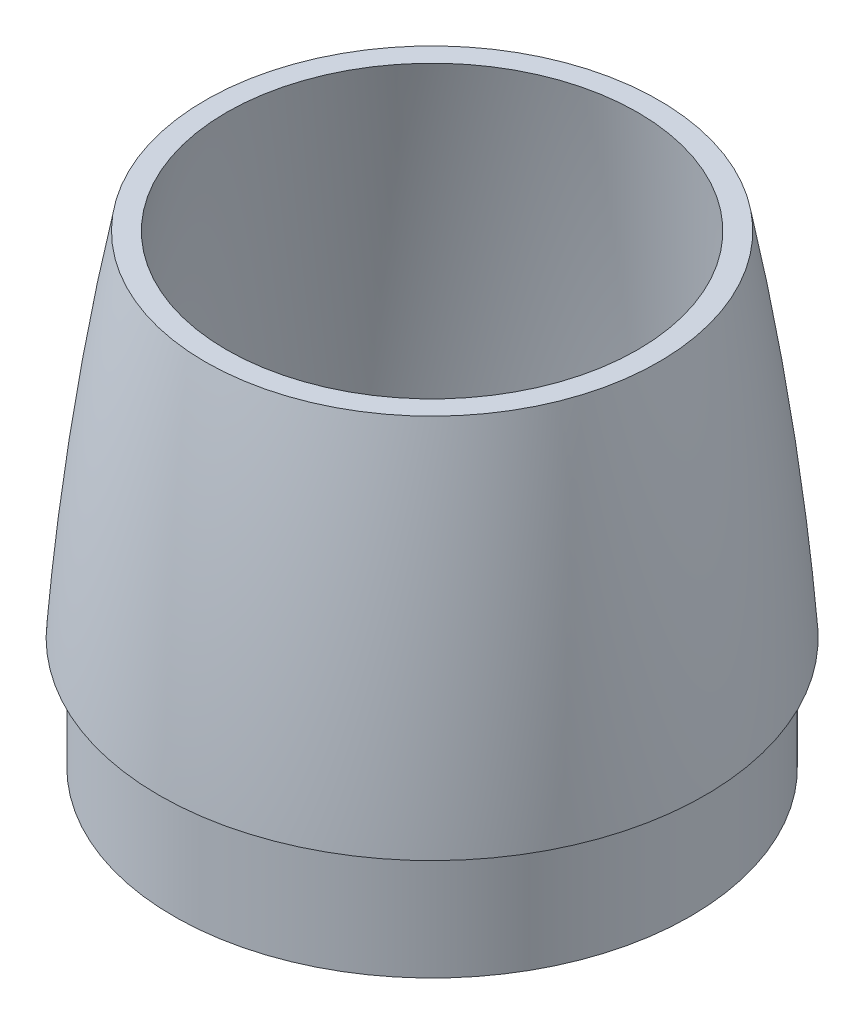
ISO-10303-21;
HEADER;
FILE_DESCRIPTION(('STEP AP214'),'2;1');
FILE_NAME('part.step','',(''),(''),'','','');
FILE_SCHEMA(('AUTOMOTIVE_DESIGN { 1 0 10303 214 1 1 1 1 }'));
ENDSEC;
DATA;
#1=APPLICATION_CONTEXT('core data for automotive mechanical design processes');
#2=APPLICATION_PROTOCOL_DEFINITION('international standard','automotive_design',2000,#1);
#3=PRODUCT_CONTEXT('',#1,'mechanical');
#4=PRODUCT('Part','Part','',(#3));
#5=PRODUCT_RELATED_PRODUCT_CATEGORY('part','',(#4));
#6=PRODUCT_DEFINITION_FORMATION('','',#4);
#7=PRODUCT_DEFINITION_CONTEXT('part definition',#1,'design');
#8=PRODUCT_DEFINITION('design','',#6,#7);
#9=PRODUCT_DEFINITION_SHAPE('','',#8);
#10=(LENGTH_UNIT() NAMED_UNIT(*) SI_UNIT(.MILLI.,.METRE.));
#11=(NAMED_UNIT(*) PLANE_ANGLE_UNIT() SI_UNIT($,.RADIAN.));
#12=(NAMED_UNIT(*) SI_UNIT($,.STERADIAN.) SOLID_ANGLE_UNIT());
#13=UNCERTAINTY_MEASURE_WITH_UNIT(LENGTH_MEASURE(1.E-05),#10,'distance_accuracy_value','');
#14=(GEOMETRIC_REPRESENTATION_CONTEXT(3) GLOBAL_UNCERTAINTY_ASSIGNED_CONTEXT((#13)) GLOBAL_UNIT_ASSIGNED_CONTEXT((#10,
#11,#12)) REPRESENTATION_CONTEXT('',''));
#15=CARTESIAN_POINT('',(0.,0.,0.));
#16=DIRECTION('',(0.,0.,1.));
#17=DIRECTION('',(1.,0.,0.));
#18=AXIS2_PLACEMENT_3D('',#15,#16,#17);
#19=CARTESIAN_POINT('',(-7.7715611723761E-13,-78.5092148022549,0.));
#20=DIRECTION('',(0.,1.,0.));
#21=DIRECTION('',(-1.,0.,0.));
#22=AXIS2_PLACEMENT_3D('',#19,#20,#21);
#23=DEGENERATE_TOROIDAL_SURFACE('',#22,992.11349278293,1093.36082838655,.F.);
#24=CARTESIAN_POINT('',(-6.53226602665202E-13,-1.66533453693773E-13,0.));
#25=DIRECTION('',(0.,1.,0.));
#26=DIRECTION('',(-1.,0.,0.));
#27=AXIS2_PLACEMENT_3D('',#24,#25,#26);
#28=CIRCLE('',#27,98.4249999999993);
#29=CARTESIAN_POINT('',(-98.425,0.,0.));
#30=VERTEX_POINT('',#29);
#31=EDGE_CURVE('E10',#30,#30,#28,.T.);
#32=ORIENTED_EDGE('',*,*,#31,.T.);
#33=EDGE_LOOP('',(#32));
#34=FACE_BOUND('',#33,.T.);
#35=CARTESIAN_POINT('',(-7.7715611723761E-13,127.,0.));
#36=DIRECTION('',(0.,1.,0.));
#37=DIRECTION('',(0.,0.,1.));
#38=AXIS2_PLACEMENT_3D('',#35,#36,#37);
#39=CIRCLE('',#38,81.7598068579033);
#40=CARTESIAN_POINT('',(-7.7715611723761E-13,127.,81.7598068579033));
#41=VERTEX_POINT('',#40);
#42=EDGE_CURVE('E67',#41,#41,#39,.F.);
#43=ORIENTED_EDGE('',*,*,#42,.T.);
#44=EDGE_LOOP('',(#43));
#45=FACE_BOUND('',#44,.T.);
#46=ADVANCED_FACE('F39',(#34,#45),#23,.F.);
#47=CARTESIAN_POINT('',(-8.88178419700125E-13,-90.9690996932709,0.));
#48=DIRECTION('',(0.,1.,0.));
#49=DIRECTION('',(-1.,0.,0.));
#50=AXIS2_PLACEMENT_3D('',#47,#48,#49);
#51=DEGENERATE_TOROIDAL_SURFACE('',#50,1112.69102888091,1206.67591223346,.F.);
#52=CARTESIAN_POINT('',(-6.53226602665202E-13,0.,0.));
#53=DIRECTION('',(0.,1.,0.));
#54=DIRECTION('',(-1.,0.,0.));
#55=AXIS2_PLACEMENT_3D('',#52,#53,#54);
#56=CIRCLE('',#55,90.5509999999994);
#57=CARTESIAN_POINT('',(-90.551,0.,0.));
#58=VERTEX_POINT('',#57);
#59=EDGE_CURVE('E47',#58,#58,#56,.T.);
#60=ORIENTED_EDGE('',*,*,#59,.F.);
#61=EDGE_LOOP('',(#60));
#62=FACE_BOUND('',#61,.T.);
#63=CARTESIAN_POINT('',(-8.88178419700125E-13,127.,0.));
#64=DIRECTION('',(0.,1.,0.));
#65=DIRECTION('',(0.,0.,1.));
#66=AXIS2_PLACEMENT_3D('',#63,#64,#65);
#67=CIRCLE('',#66,74.1350867499166);
#68=CARTESIAN_POINT('',(-8.88178419700125E-13,127.,74.1350867499166));
#69=VERTEX_POINT('',#68);
#70=EDGE_CURVE('E42',#69,#69,#67,.T.);
#71=ORIENTED_EDGE('',*,*,#70,.T.);
#72=EDGE_LOOP('',(#71));
#73=FACE_BOUND('',#72,.T.);
#74=ADVANCED_FACE('F79',(#62,#73),#51,.T.);
#75=CARTESIAN_POINT('',(-98.425,0.,0.));
#76=DIRECTION('',(0.,-1.,0.));
#77=DIRECTION('',(1.,0.,0.));
#78=AXIS2_PLACEMENT_3D('',#75,#76,#77);
#79=PLANE('',#78);
#80=CARTESIAN_POINT('',(0.,0.,0.));
#81=DIRECTION('',(0.,-1.,0.));
#82=DIRECTION('',(1.,0.,0.));
#83=AXIS2_PLACEMENT_3D('',#80,#81,#82);
#84=CIRCLE('',#83,93.1545);
#85=CARTESIAN_POINT('',(93.1545,-1.59713904351642E-13,0.));
#86=VERTEX_POINT('',#85);
#87=EDGE_CURVE('E55',#86,#86,#84,.T.);
#88=ORIENTED_EDGE('',*,*,#87,.F.);
#89=EDGE_LOOP('',(#88));
#90=FACE_BOUND('',#89,.T.);
#91=ORIENTED_EDGE('',*,*,#31,.F.);
#92=EDGE_LOOP('',(#91));
#93=FACE_BOUND('',#92,.T.);
#94=ADVANCED_FACE('F96',(#90,#93),#79,.T.);
#95=CARTESIAN_POINT('',(0.,0.,0.));
#96=DIRECTION('',(0.,-1.,0.));
#97=DIRECTION('',(1.,0.,0.));
#98=AXIS2_PLACEMENT_3D('',#95,#96,#97);
#99=PLANE('',#98);
#100=CARTESIAN_POINT('',(0.,0.,0.));
#101=DIRECTION('',(0.,-1.,0.));
#102=DIRECTION('',(1.,0.,0.));
#103=AXIS2_PLACEMENT_3D('',#100,#101,#102);
#104=CIRCLE('',#103,90.4875);
#105=CARTESIAN_POINT('',(90.4875,-1.55141318132985E-13,0.));
#106=VERTEX_POINT('',#105);
#107=EDGE_CURVE('E63',#106,#106,#104,.T.);
#108=ORIENTED_EDGE('',*,*,#107,.T.);
#109=EDGE_LOOP('',(#108));
#110=FACE_BOUND('',#109,.T.);
#111=ORIENTED_EDGE('',*,*,#59,.T.);
#112=EDGE_LOOP('',(#111));
#113=FACE_BOUND('',#112,.T.);
#114=ADVANCED_FACE('F102',(#110,#113),#99,.F.);
#115=CARTESIAN_POINT('',(0.,-40.3999954,0.));
#116=DIRECTION('',(0.,-1.,0.));
#117=DIRECTION('',(1.,0.,0.));
#118=AXIS2_PLACEMENT_3D('',#115,#116,#117);
#119=PLANE('',#118);
#120=CARTESIAN_POINT('',(0.,-40.3999954,0.));
#121=DIRECTION('',(0.,-1.,0.));
#122=DIRECTION('',(1.,0.,0.));
#123=AXIS2_PLACEMENT_3D('',#120,#121,#122);
#124=CIRCLE('',#123,93.1545);
#125=CARTESIAN_POINT('',(93.1544999999999,-40.3999954000002,0.));
#126=VERTEX_POINT('',#125);
#127=EDGE_CURVE('E52',#126,#126,#124,.T.);
#128=ORIENTED_EDGE('',*,*,#127,.T.);
#129=EDGE_LOOP('',(#128));
#130=FACE_BOUND('',#129,.T.);
#131=CARTESIAN_POINT('',(0.,-40.3999954,0.));
#132=DIRECTION('',(0.,-1.,0.));
#133=DIRECTION('',(1.,0.,0.));
#134=AXIS2_PLACEMENT_3D('',#131,#132,#133);
#135=CIRCLE('',#134,90.4875);
#136=CARTESIAN_POINT('',(90.4874999999999,-40.3999954000002,0.));
#137=VERTEX_POINT('',#136);
#138=EDGE_CURVE('E59',#137,#137,#135,.T.);
#139=ORIENTED_EDGE('',*,*,#138,.F.);
#140=EDGE_LOOP('',(#139));
#141=FACE_BOUND('',#140,.T.);
#142=ADVANCED_FACE('F108',(#130,#141),#119,.T.);
#143=CARTESIAN_POINT('',(0.,-40.3999954,0.));
#144=DIRECTION('',(0.,1.,0.));
#145=DIRECTION('',(-1.,0.,0.));
#146=AXIS2_PLACEMENT_3D('',#143,#144,#145);
#147=CYLINDRICAL_SURFACE('',#146,93.1545);
#148=ORIENTED_EDGE('',*,*,#127,.F.);
#149=EDGE_LOOP('',(#148));
#150=FACE_BOUND('',#149,.T.);
#151=ORIENTED_EDGE('',*,*,#87,.T.);
#152=EDGE_LOOP('',(#151));
#153=FACE_BOUND('',#152,.T.);
#154=ADVANCED_FACE('F89',(#150,#153),#147,.T.);
#155=CARTESIAN_POINT('',(0.,-40.3999954,0.));
#156=DIRECTION('',(0.,1.,0.));
#157=DIRECTION('',(-1.,0.,0.));
#158=AXIS2_PLACEMENT_3D('',#155,#156,#157);
#159=CYLINDRICAL_SURFACE('',#158,90.4875);
#160=ORIENTED_EDGE('',*,*,#138,.T.);
#161=EDGE_LOOP('',(#160));
#162=FACE_BOUND('',#161,.T.);
#163=ORIENTED_EDGE('',*,*,#107,.F.);
#164=EDGE_LOOP('',(#163));
#165=FACE_BOUND('',#164,.T.);
#166=ADVANCED_FACE('F83',(#162,#165),#159,.F.);
#167=CARTESIAN_POINT('',(0.,127.,0.));
#168=DIRECTION('',(0.,1.,0.));
#169=DIRECTION('',(0.,0.,1.));
#170=AXIS2_PLACEMENT_3D('',#167,#168,#169);
#171=PLANE('',#170);
#172=ORIENTED_EDGE('',*,*,#42,.F.);
#173=EDGE_LOOP('',(#172));
#174=FACE_BOUND('',#173,.T.);
#175=ORIENTED_EDGE('',*,*,#70,.F.);
#176=EDGE_LOOP('',(#175));
#177=FACE_BOUND('',#176,.T.);
#178=ADVANCED_FACE('F81',(#174,#177),#171,.T.);
#179=CLOSED_SHELL('',(#46,#74,#94,#114,#142,#154,#166,#178));
#180=MANIFOLD_SOLID_BREP('B2',#179);
#181=ADVANCED_BREP_SHAPE_REPRESENTATION('',(#18,#180),#14);
#182=SHAPE_DEFINITION_REPRESENTATION(#9,#181);
ENDSEC;
END-ISO-10303-21;
